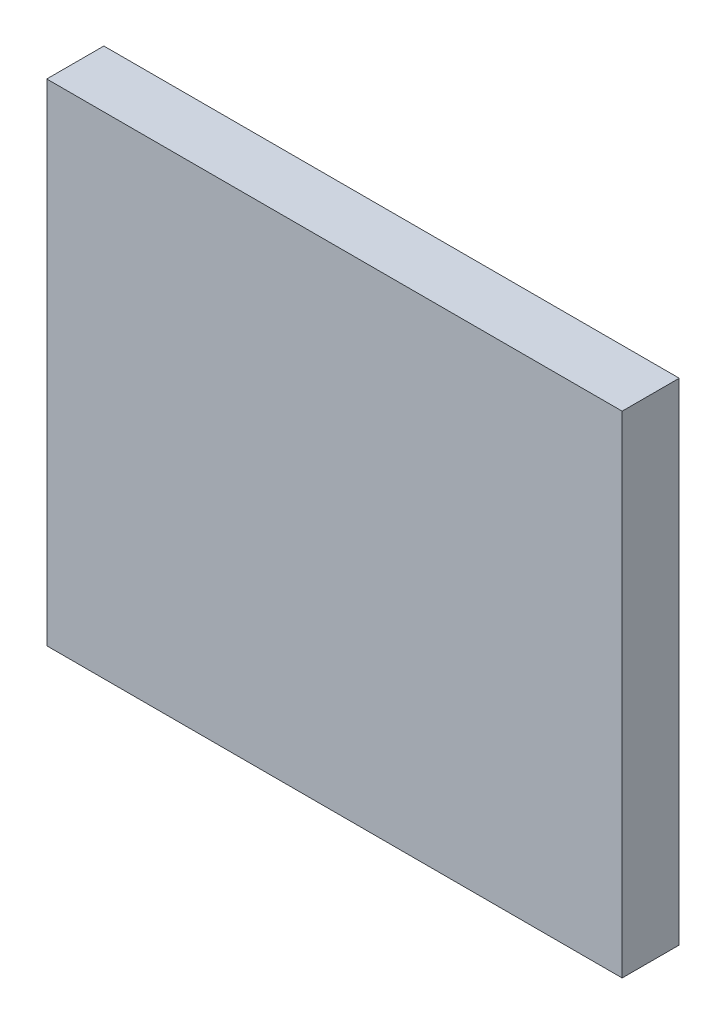
ISO-10303-21;
HEADER;
FILE_DESCRIPTION(('STEP AP214'),'2;1');
FILE_NAME('part.step','',(''),(''),'','','');
FILE_SCHEMA(('AUTOMOTIVE_DESIGN { 1 0 10303 214 1 1 1 1 }'));
ENDSEC;
DATA;
#1=APPLICATION_CONTEXT('core data for automotive mechanical design processes');
#2=APPLICATION_PROTOCOL_DEFINITION('international standard','automotive_design',2000,#1);
#3=PRODUCT_CONTEXT('',#1,'mechanical');
#4=PRODUCT('Part','Part','',(#3));
#5=PRODUCT_RELATED_PRODUCT_CATEGORY('part','',(#4));
#6=PRODUCT_DEFINITION_FORMATION('','',#4);
#7=PRODUCT_DEFINITION_CONTEXT('part definition',#1,'design');
#8=PRODUCT_DEFINITION('design','',#6,#7);
#9=PRODUCT_DEFINITION_SHAPE('','',#8);
#10=(LENGTH_UNIT() NAMED_UNIT(*) SI_UNIT(.MILLI.,.METRE.));
#11=(NAMED_UNIT(*) PLANE_ANGLE_UNIT() SI_UNIT($,.RADIAN.));
#12=(NAMED_UNIT(*) SI_UNIT($,.STERADIAN.) SOLID_ANGLE_UNIT());
#13=UNCERTAINTY_MEASURE_WITH_UNIT(LENGTH_MEASURE(1.E-05),#10,'distance_accuracy_value','');
#14=(GEOMETRIC_REPRESENTATION_CONTEXT(3) GLOBAL_UNCERTAINTY_ASSIGNED_CONTEXT((#13)) GLOBAL_UNIT_ASSIGNED_CONTEXT((#10,
#11,#12)) REPRESENTATION_CONTEXT('',''));
#15=CARTESIAN_POINT('',(0.,0.,0.));
#16=DIRECTION('',(0.,0.,1.));
#17=DIRECTION('',(1.,0.,0.));
#18=AXIS2_PLACEMENT_3D('',#15,#16,#17);
#19=CARTESIAN_POINT('',(12.6,-10.75,2.5));
#20=DIRECTION('',(-1.,0.,0.));
#21=DIRECTION('',(0.,0.,1.));
#22=AXIS2_PLACEMENT_3D('',#19,#20,#21);
#23=PLANE('',#22);
#24=DIRECTION('',(0.,1.,0.));
#25=VECTOR('',#24,1.);
#26=CARTESIAN_POINT('',(12.6,-10.75,0.));
#27=LINE('',#26,#25);
#28=CARTESIAN_POINT('',(12.6,-10.75,0.));
#29=VERTEX_POINT('',#28);
#30=CARTESIAN_POINT('',(12.6,10.75,0.));
#31=VERTEX_POINT('',#30);
#32=EDGE_CURVE('E104',#29,#31,#27,.T.);
#33=ORIENTED_EDGE('',*,*,#32,.T.);
#34=DIRECTION('',(0.,0.,-1.));
#35=VECTOR('',#34,1.);
#36=CARTESIAN_POINT('',(12.6,10.75,2.5));
#37=LINE('',#36,#35);
#38=CARTESIAN_POINT('',(12.6,10.75,2.5));
#39=VERTEX_POINT('',#38);
#40=EDGE_CURVE('E11',#39,#31,#37,.T.);
#41=ORIENTED_EDGE('',*,*,#40,.F.);
#42=DIRECTION('',(0.,1.,0.));
#43=VECTOR('',#42,1.);
#44=CARTESIAN_POINT('',(12.6,-10.75,2.5));
#45=LINE('',#44,#43);
#46=CARTESIAN_POINT('',(12.6,-10.75,2.5));
#47=VERTEX_POINT('',#46);
#48=EDGE_CURVE('E92',#47,#39,#45,.T.);
#49=ORIENTED_EDGE('',*,*,#48,.F.);
#50=DIRECTION('',(0.,0.,-1.));
#51=VECTOR('',#50,1.);
#52=CARTESIAN_POINT('',(12.6,-10.75,2.5));
#53=LINE('',#52,#51);
#54=EDGE_CURVE('E100',#47,#29,#53,.T.);
#55=ORIENTED_EDGE('',*,*,#54,.T.);
#56=EDGE_LOOP('',(#33,#41,#49,#55));
#57=FACE_BOUND('',#56,.T.);
#58=ADVANCED_FACE('F41',(#57),#23,.F.);
#59=CARTESIAN_POINT('',(-12.6,10.75,2.5));
#60=DIRECTION('',(0.,-1.,0.));
#61=DIRECTION('',(0.,0.,-1.));
#62=AXIS2_PLACEMENT_3D('',#59,#60,#61);
#63=PLANE('',#62);
#64=DIRECTION('',(-1.,0.,0.));
#65=VECTOR('',#64,1.);
#66=CARTESIAN_POINT('',(-12.6,10.75,0.));
#67=LINE('',#66,#65);
#68=CARTESIAN_POINT('',(-12.6,10.75,0.));
#69=VERTEX_POINT('',#68);
#70=EDGE_CURVE('E96',#31,#69,#67,.T.);
#71=ORIENTED_EDGE('',*,*,#70,.T.);
#72=DIRECTION('',(0.,0.,-1.));
#73=VECTOR('',#72,1.);
#74=CARTESIAN_POINT('',(-12.6,10.75,2.5));
#75=LINE('',#74,#73);
#76=CARTESIAN_POINT('',(-12.6,10.75,2.5));
#77=VERTEX_POINT('',#76);
#78=EDGE_CURVE('E49',#77,#69,#75,.T.);
#79=ORIENTED_EDGE('',*,*,#78,.F.);
#80=DIRECTION('',(-1.,0.,0.));
#81=VECTOR('',#80,1.);
#82=CARTESIAN_POINT('',(-12.6,10.75,2.5));
#83=LINE('',#82,#81);
#84=EDGE_CURVE('E87',#39,#77,#83,.T.);
#85=ORIENTED_EDGE('',*,*,#84,.F.);
#86=ORIENTED_EDGE('',*,*,#40,.T.);
#87=EDGE_LOOP('',(#71,#79,#85,#86));
#88=FACE_BOUND('',#87,.T.);
#89=ADVANCED_FACE('F95',(#88),#63,.F.);
#90=CARTESIAN_POINT('',(-12.6,-10.75,2.5));
#91=DIRECTION('',(1.,0.,0.));
#92=DIRECTION('',(0.,0.,-1.));
#93=AXIS2_PLACEMENT_3D('',#90,#91,#92);
#94=PLANE('',#93);
#95=DIRECTION('',(0.,-1.,0.));
#96=VECTOR('',#95,1.);
#97=CARTESIAN_POINT('',(-12.6,-10.75,0.));
#98=LINE('',#97,#96);
#99=CARTESIAN_POINT('',(-12.6,-10.75,0.));
#100=VERTEX_POINT('',#99);
#101=EDGE_CURVE('E74',#69,#100,#98,.T.);
#102=ORIENTED_EDGE('',*,*,#101,.T.);
#103=DIRECTION('',(0.,0.,-1.));
#104=VECTOR('',#103,1.);
#105=CARTESIAN_POINT('',(-12.6,-10.75,2.5));
#106=LINE('',#105,#104);
#107=CARTESIAN_POINT('',(-12.6,-10.75,2.5));
#108=VERTEX_POINT('',#107);
#109=EDGE_CURVE('E97',#108,#100,#106,.T.);
#110=ORIENTED_EDGE('',*,*,#109,.F.);
#111=DIRECTION('',(0.,-1.,0.));
#112=VECTOR('',#111,1.);
#113=CARTESIAN_POINT('',(-12.6,-10.75,2.5));
#114=LINE('',#113,#112);
#115=EDGE_CURVE('E90',#77,#108,#114,.T.);
#116=ORIENTED_EDGE('',*,*,#115,.F.);
#117=ORIENTED_EDGE('',*,*,#78,.T.);
#118=EDGE_LOOP('',(#102,#110,#116,#117));
#119=FACE_BOUND('',#118,.T.);
#120=ADVANCED_FACE('F98',(#119),#94,.F.);
#121=CARTESIAN_POINT('',(-12.6,-10.75,2.5));
#122=DIRECTION('',(0.,1.,0.));
#123=DIRECTION('',(0.,0.,1.));
#124=AXIS2_PLACEMENT_3D('',#121,#122,#123);
#125=PLANE('',#124);
#126=DIRECTION('',(1.,0.,0.));
#127=VECTOR('',#126,1.);
#128=CARTESIAN_POINT('',(-12.6,-10.75,0.));
#129=LINE('',#128,#127);
#130=EDGE_CURVE('E80',#100,#29,#129,.T.);
#131=ORIENTED_EDGE('',*,*,#130,.T.);
#132=ORIENTED_EDGE('',*,*,#54,.F.);
#133=DIRECTION('',(1.,0.,0.));
#134=VECTOR('',#133,1.);
#135=CARTESIAN_POINT('',(-12.6,-10.75,2.5));
#136=LINE('',#135,#134);
#137=EDGE_CURVE('E57',#108,#47,#136,.T.);
#138=ORIENTED_EDGE('',*,*,#137,.F.);
#139=ORIENTED_EDGE('',*,*,#109,.T.);
#140=EDGE_LOOP('',(#131,#132,#138,#139));
#141=FACE_BOUND('',#140,.T.);
#142=ADVANCED_FACE('F111',(#141),#125,.F.);
#143=CARTESIAN_POINT('',(0.,0.,2.5));
#144=DIRECTION('',(0.,0.,-1.));
#145=DIRECTION('',(-1.,0.,0.));
#146=AXIS2_PLACEMENT_3D('',#143,#144,#145);
#147=PLANE('',#146);
#148=ORIENTED_EDGE('',*,*,#48,.T.);
#149=ORIENTED_EDGE('',*,*,#84,.T.);
#150=ORIENTED_EDGE('',*,*,#115,.T.);
#151=ORIENTED_EDGE('',*,*,#137,.T.);
#152=EDGE_LOOP('',(#148,#149,#150,#151));
#153=FACE_BOUND('',#152,.T.);
#154=ADVANCED_FACE('F88',(#153),#147,.F.);
#155=CARTESIAN_POINT('',(0.,0.,0.));
#156=DIRECTION('',(0.,0.,-1.));
#157=DIRECTION('',(-1.,0.,0.));
#158=AXIS2_PLACEMENT_3D('',#155,#156,#157);
#159=PLANE('',#158);
#160=ORIENTED_EDGE('',*,*,#32,.F.);
#161=ORIENTED_EDGE('',*,*,#130,.F.);
#162=ORIENTED_EDGE('',*,*,#101,.F.);
#163=ORIENTED_EDGE('',*,*,#70,.F.);
#164=EDGE_LOOP('',(#160,#161,#162,#163));
#165=FACE_BOUND('',#164,.T.);
#166=ADVANCED_FACE('F114',(#165),#159,.T.);
#167=CLOSED_SHELL('',(#58,#89,#120,#142,#154,#166));
#168=MANIFOLD_SOLID_BREP('B2',#167);
#169=ADVANCED_BREP_SHAPE_REPRESENTATION('',(#18,#168),#14);
#170=SHAPE_DEFINITION_REPRESENTATION(#9,#169);
ENDSEC;
END-ISO-10303-21;
